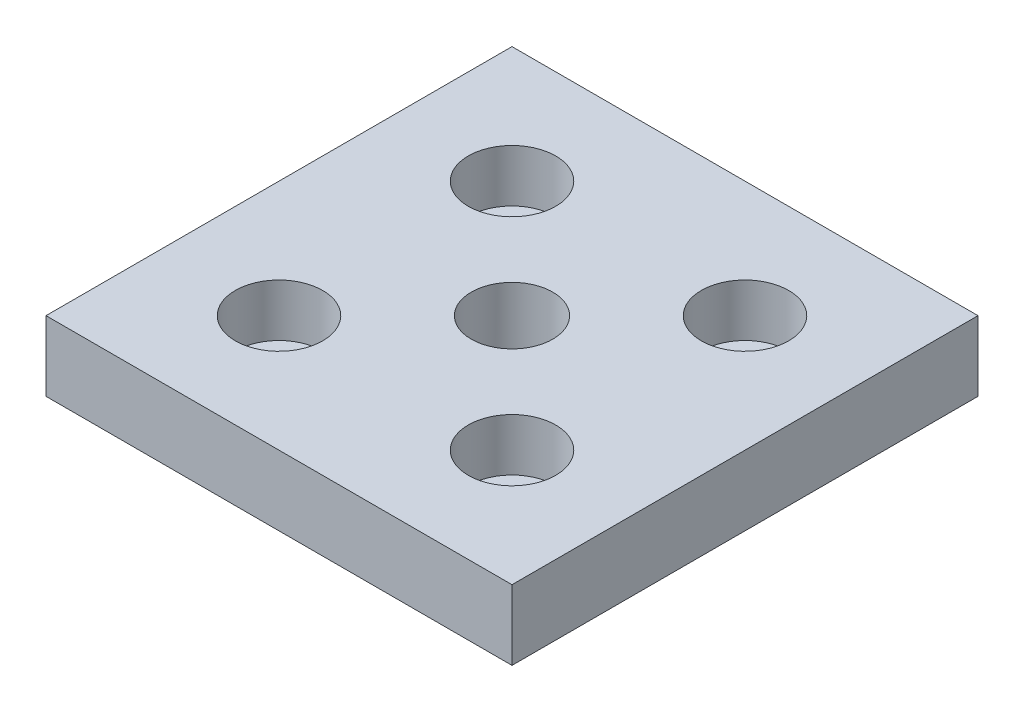
ISO-10303-21;
HEADER;
FILE_DESCRIPTION(('STEP AP214'),'2;1');
FILE_NAME('part.step','',(''),(''),'','','');
FILE_SCHEMA(('AUTOMOTIVE_DESIGN { 1 0 10303 214 1 1 1 1 }'));
ENDSEC;
DATA;
#1=APPLICATION_CONTEXT('core data for automotive mechanical design processes');
#2=APPLICATION_PROTOCOL_DEFINITION('international standard','automotive_design',2000,#1);
#3=PRODUCT_CONTEXT('',#1,'mechanical');
#4=PRODUCT('Part','Part','',(#3));
#5=PRODUCT_RELATED_PRODUCT_CATEGORY('part','',(#4));
#6=PRODUCT_DEFINITION_FORMATION('','',#4);
#7=PRODUCT_DEFINITION_CONTEXT('part definition',#1,'design');
#8=PRODUCT_DEFINITION('design','',#6,#7);
#9=PRODUCT_DEFINITION_SHAPE('','',#8);
#10=(LENGTH_UNIT() NAMED_UNIT(*) SI_UNIT(.MILLI.,.METRE.));
#11=(NAMED_UNIT(*) PLANE_ANGLE_UNIT() SI_UNIT($,.RADIAN.));
#12=(NAMED_UNIT(*) SI_UNIT($,.STERADIAN.) SOLID_ANGLE_UNIT());
#13=UNCERTAINTY_MEASURE_WITH_UNIT(LENGTH_MEASURE(1.E-05),#10,'distance_accuracy_value','');
#14=(GEOMETRIC_REPRESENTATION_CONTEXT(3) GLOBAL_UNCERTAINTY_ASSIGNED_CONTEXT((#13)) GLOBAL_UNIT_ASSIGNED_CONTEXT((#10,
#11,#12)) REPRESENTATION_CONTEXT('',''));
#15=CARTESIAN_POINT('',(0.,0.,0.));
#16=DIRECTION('',(0.,0.,1.));
#17=DIRECTION('',(1.,0.,0.));
#18=AXIS2_PLACEMENT_3D('',#15,#16,#17);
#19=CARTESIAN_POINT('',(-20.,0.,-20.));
#20=DIRECTION('',(0.,1.,0.));
#21=DIRECTION('',(0.,0.,1.));
#22=AXIS2_PLACEMENT_3D('',#19,#20,#21);
#23=CYLINDRICAL_SURFACE('',#22,4.5);
#24=CARTESIAN_POINT('',(-20.,0.,-20.));
#25=DIRECTION('',(0.,1.,0.));
#26=DIRECTION('',(0.,0.,1.));
#27=AXIS2_PLACEMENT_3D('',#24,#25,#26);
#28=CIRCLE('',#27,4.5);
#29=CARTESIAN_POINT('',(-20.,0.,-15.5));
#30=VERTEX_POINT('',#29);
#31=EDGE_CURVE('E137',#30,#30,#28,.T.);
#32=ORIENTED_EDGE('',*,*,#31,.F.);
#33=EDGE_LOOP('',(#32));
#34=FACE_BOUND('',#33,.T.);
#35=CARTESIAN_POINT('',(-20.,3.,-20.));
#36=DIRECTION('',(0.,1.,0.));
#37=DIRECTION('',(0.,0.,1.));
#38=AXIS2_PLACEMENT_3D('',#35,#36,#37);
#39=CIRCLE('',#38,4.5);
#40=CARTESIAN_POINT('',(-20.,3.,-15.5));
#41=VERTEX_POINT('',#40);
#42=EDGE_CURVE('E41',#41,#41,#39,.F.);
#43=ORIENTED_EDGE('',*,*,#42,.F.);
#44=EDGE_LOOP('',(#43));
#45=FACE_BOUND('',#44,.T.);
#46=ADVANCED_FACE('F37',(#34,#45),#23,.F.);
#47=CARTESIAN_POINT('',(20.,0.,-20.));
#48=DIRECTION('',(0.,1.,0.));
#49=DIRECTION('',(0.,0.,1.));
#50=AXIS2_PLACEMENT_3D('',#47,#48,#49);
#51=CYLINDRICAL_SURFACE('',#50,4.5);
#52=CARTESIAN_POINT('',(20.,0.,-20.));
#53=DIRECTION('',(0.,1.,0.));
#54=DIRECTION('',(0.,0.,1.));
#55=AXIS2_PLACEMENT_3D('',#52,#53,#54);
#56=CIRCLE('',#55,4.5);
#57=CARTESIAN_POINT('',(20.,0.,-15.5));
#58=VERTEX_POINT('',#57);
#59=EDGE_CURVE('E133',#58,#58,#56,.T.);
#60=ORIENTED_EDGE('',*,*,#59,.F.);
#61=EDGE_LOOP('',(#60));
#62=FACE_BOUND('',#61,.T.);
#63=CARTESIAN_POINT('',(20.,3.,-20.));
#64=DIRECTION('',(0.,1.,0.));
#65=DIRECTION('',(0.,0.,1.));
#66=AXIS2_PLACEMENT_3D('',#63,#64,#65);
#67=CIRCLE('',#66,4.5);
#68=CARTESIAN_POINT('',(20.,3.,-15.5));
#69=VERTEX_POINT('',#68);
#70=EDGE_CURVE('E119',#69,#69,#67,.F.);
#71=ORIENTED_EDGE('',*,*,#70,.F.);
#72=EDGE_LOOP('',(#71));
#73=FACE_BOUND('',#72,.T.);
#74=ADVANCED_FACE('F165',(#62,#73),#51,.F.);
#75=CARTESIAN_POINT('',(20.,0.,20.));
#76=DIRECTION('',(0.,1.,0.));
#77=DIRECTION('',(0.,0.,1.));
#78=AXIS2_PLACEMENT_3D('',#75,#76,#77);
#79=CYLINDRICAL_SURFACE('',#78,4.5);
#80=CARTESIAN_POINT('',(20.,0.,20.));
#81=DIRECTION('',(0.,1.,0.));
#82=DIRECTION('',(0.,0.,1.));
#83=AXIS2_PLACEMENT_3D('',#80,#81,#82);
#84=CIRCLE('',#83,4.5);
#85=CARTESIAN_POINT('',(20.,0.,24.5));
#86=VERTEX_POINT('',#85);
#87=EDGE_CURVE('E128',#86,#86,#84,.T.);
#88=ORIENTED_EDGE('',*,*,#87,.F.);
#89=EDGE_LOOP('',(#88));
#90=FACE_BOUND('',#89,.T.);
#91=CARTESIAN_POINT('',(20.,3.,20.));
#92=DIRECTION('',(0.,1.,0.));
#93=DIRECTION('',(0.,0.,1.));
#94=AXIS2_PLACEMENT_3D('',#91,#92,#93);
#95=CIRCLE('',#94,4.5);
#96=CARTESIAN_POINT('',(20.,3.,24.5));
#97=VERTEX_POINT('',#96);
#98=EDGE_CURVE('E116',#97,#97,#95,.F.);
#99=ORIENTED_EDGE('',*,*,#98,.F.);
#100=EDGE_LOOP('',(#99));
#101=FACE_BOUND('',#100,.T.);
#102=ADVANCED_FACE('F171',(#90,#101),#79,.F.);
#103=CARTESIAN_POINT('',(-20.,0.,20.));
#104=DIRECTION('',(0.,1.,0.));
#105=DIRECTION('',(0.,0.,1.));
#106=AXIS2_PLACEMENT_3D('',#103,#104,#105);
#107=CYLINDRICAL_SURFACE('',#106,4.5);
#108=CARTESIAN_POINT('',(-20.,0.,20.));
#109=DIRECTION('',(0.,1.,0.));
#110=DIRECTION('',(0.,0.,1.));
#111=AXIS2_PLACEMENT_3D('',#108,#109,#110);
#112=CIRCLE('',#111,4.5);
#113=CARTESIAN_POINT('',(-20.,0.,24.5));
#114=VERTEX_POINT('',#113);
#115=EDGE_CURVE('E124',#114,#114,#112,.T.);
#116=ORIENTED_EDGE('',*,*,#115,.F.);
#117=EDGE_LOOP('',(#116));
#118=FACE_BOUND('',#117,.T.);
#119=CARTESIAN_POINT('',(-20.,3.,20.));
#120=DIRECTION('',(0.,1.,0.));
#121=DIRECTION('',(0.,0.,1.));
#122=AXIS2_PLACEMENT_3D('',#119,#120,#121);
#123=CIRCLE('',#122,4.5);
#124=CARTESIAN_POINT('',(-20.,3.,24.5));
#125=VERTEX_POINT('',#124);
#126=EDGE_CURVE('E113',#125,#125,#123,.F.);
#127=ORIENTED_EDGE('',*,*,#126,.F.);
#128=EDGE_LOOP('',(#127));
#129=FACE_BOUND('',#128,.T.);
#130=ADVANCED_FACE('F178',(#118,#129),#107,.F.);
#131=CARTESIAN_POINT('',(40.,12.,40.));
#132=DIRECTION('',(-1.,0.,0.));
#133=DIRECTION('',(0.,0.,1.));
#134=AXIS2_PLACEMENT_3D('',#131,#132,#133);
#135=PLANE('',#134);
#136=DIRECTION('',(0.,0.,-1.));
#137=VECTOR('',#136,1.);
#138=CARTESIAN_POINT('',(40.,0.,40.));
#139=LINE('',#138,#137);
#140=CARTESIAN_POINT('',(40.,0.,40.));
#141=VERTEX_POINT('',#140);
#142=CARTESIAN_POINT('',(40.,0.,-40.));
#143=VERTEX_POINT('',#142);
#144=EDGE_CURVE('E104',#141,#143,#139,.T.);
#145=ORIENTED_EDGE('',*,*,#144,.T.);
#146=DIRECTION('',(0.,-1.,0.));
#147=VECTOR('',#146,1.);
#148=CARTESIAN_POINT('',(40.,12.,-40.));
#149=LINE('',#148,#147);
#150=CARTESIAN_POINT('',(40.,12.,-40.));
#151=VERTEX_POINT('',#150);
#152=EDGE_CURVE('E11',#151,#143,#149,.T.);
#153=ORIENTED_EDGE('',*,*,#152,.F.);
#154=DIRECTION('',(0.,0.,-1.));
#155=VECTOR('',#154,1.);
#156=CARTESIAN_POINT('',(40.,12.,40.));
#157=LINE('',#156,#155);
#158=CARTESIAN_POINT('',(40.,12.,40.));
#159=VERTEX_POINT('',#158);
#160=EDGE_CURVE('E91',#159,#151,#157,.T.);
#161=ORIENTED_EDGE('',*,*,#160,.F.);
#162=DIRECTION('',(0.,-1.,0.));
#163=VECTOR('',#162,1.);
#164=CARTESIAN_POINT('',(40.,12.,40.));
#165=LINE('',#164,#163);
#166=EDGE_CURVE('E100',#159,#141,#165,.T.);
#167=ORIENTED_EDGE('',*,*,#166,.T.);
#168=EDGE_LOOP('',(#145,#153,#161,#167));
#169=FACE_BOUND('',#168,.T.);
#170=ADVANCED_FACE('F39',(#169),#135,.F.);
#171=CARTESIAN_POINT('',(-40.,12.,-40.));
#172=DIRECTION('',(0.,0.,1.));
#173=DIRECTION('',(1.,0.,0.));
#174=AXIS2_PLACEMENT_3D('',#171,#172,#173);
#175=PLANE('',#174);
#176=DIRECTION('',(-1.,0.,0.));
#177=VECTOR('',#176,1.);
#178=CARTESIAN_POINT('',(-40.,0.,-40.));
#179=LINE('',#178,#177);
#180=CARTESIAN_POINT('',(-40.,0.,-40.));
#181=VERTEX_POINT('',#180);
#182=EDGE_CURVE('E95',#143,#181,#179,.T.);
#183=ORIENTED_EDGE('',*,*,#182,.T.);
#184=DIRECTION('',(0.,-1.,0.));
#185=VECTOR('',#184,1.);
#186=CARTESIAN_POINT('',(-40.,12.,-40.));
#187=LINE('',#186,#185);
#188=CARTESIAN_POINT('',(-40.,12.,-40.));
#189=VERTEX_POINT('',#188);
#190=EDGE_CURVE('E47',#189,#181,#187,.T.);
#191=ORIENTED_EDGE('',*,*,#190,.F.);
#192=DIRECTION('',(-1.,0.,0.));
#193=VECTOR('',#192,1.);
#194=CARTESIAN_POINT('',(-40.,12.,-40.));
#195=LINE('',#194,#193);
#196=EDGE_CURVE('E86',#151,#189,#195,.T.);
#197=ORIENTED_EDGE('',*,*,#196,.F.);
#198=ORIENTED_EDGE('',*,*,#152,.T.);
#199=EDGE_LOOP('',(#183,#191,#197,#198));
#200=FACE_BOUND('',#199,.T.);
#201=ADVANCED_FACE('F94',(#200),#175,.F.);
#202=CARTESIAN_POINT('',(-40.,12.,40.));
#203=DIRECTION('',(1.,0.,0.));
#204=DIRECTION('',(0.,0.,-1.));
#205=AXIS2_PLACEMENT_3D('',#202,#203,#204);
#206=PLANE('',#205);
#207=DIRECTION('',(0.,0.,1.));
#208=VECTOR('',#207,1.);
#209=CARTESIAN_POINT('',(-40.,0.,40.));
#210=LINE('',#209,#208);
#211=CARTESIAN_POINT('',(-40.,0.,40.));
#212=VERTEX_POINT('',#211);
#213=EDGE_CURVE('E73',#181,#212,#210,.T.);
#214=ORIENTED_EDGE('',*,*,#213,.T.);
#215=DIRECTION('',(0.,-1.,0.));
#216=VECTOR('',#215,1.);
#217=CARTESIAN_POINT('',(-40.,12.,40.));
#218=LINE('',#217,#216);
#219=CARTESIAN_POINT('',(-40.,12.,40.));
#220=VERTEX_POINT('',#219);
#221=EDGE_CURVE('E96',#220,#212,#218,.T.);
#222=ORIENTED_EDGE('',*,*,#221,.F.);
#223=DIRECTION('',(0.,0.,1.));
#224=VECTOR('',#223,1.);
#225=CARTESIAN_POINT('',(-40.,12.,40.));
#226=LINE('',#225,#224);
#227=EDGE_CURVE('E89',#189,#220,#226,.T.);
#228=ORIENTED_EDGE('',*,*,#227,.F.);
#229=ORIENTED_EDGE('',*,*,#190,.T.);
#230=EDGE_LOOP('',(#214,#222,#228,#229));
#231=FACE_BOUND('',#230,.T.);
#232=ADVANCED_FACE('F98',(#231),#206,.F.);
#233=CARTESIAN_POINT('',(-40.,12.,40.));
#234=DIRECTION('',(0.,0.,-1.));
#235=DIRECTION('',(-1.,0.,0.));
#236=AXIS2_PLACEMENT_3D('',#233,#234,#235);
#237=PLANE('',#236);
#238=DIRECTION('',(1.,0.,0.));
#239=VECTOR('',#238,1.);
#240=CARTESIAN_POINT('',(-40.,0.,40.));
#241=LINE('',#240,#239);
#242=EDGE_CURVE('E79',#212,#141,#241,.T.);
#243=ORIENTED_EDGE('',*,*,#242,.T.);
#244=ORIENTED_EDGE('',*,*,#166,.F.);
#245=DIRECTION('',(1.,0.,0.));
#246=VECTOR('',#245,1.);
#247=CARTESIAN_POINT('',(-40.,12.,40.));
#248=LINE('',#247,#246);
#249=EDGE_CURVE('E56',#220,#159,#248,.T.);
#250=ORIENTED_EDGE('',*,*,#249,.F.);
#251=ORIENTED_EDGE('',*,*,#221,.T.);
#252=EDGE_LOOP('',(#243,#244,#250,#251));
#253=FACE_BOUND('',#252,.T.);
#254=ADVANCED_FACE('F154',(#253),#237,.F.);
#255=CARTESIAN_POINT('',(0.,12.,0.));
#256=DIRECTION('',(0.,-1.,0.));
#257=DIRECTION('',(0.,0.,-1.));
#258=AXIS2_PLACEMENT_3D('',#255,#256,#257);
#259=PLANE('',#258);
#260=CARTESIAN_POINT('',(-20.,12.,20.));
#261=DIRECTION('',(0.,1.,0.));
#262=DIRECTION('',(0.,0.,1.));
#263=AXIS2_PLACEMENT_3D('',#260,#261,#262);
#264=CIRCLE('',#263,7.5);
#265=CARTESIAN_POINT('',(-20.,12.,27.5));
#266=VERTEX_POINT('',#265);
#267=EDGE_CURVE('E255',#266,#266,#264,.T.);
#268=ORIENTED_EDGE('',*,*,#267,.F.);
#269=EDGE_LOOP('',(#268));
#270=FACE_BOUND('',#269,.T.);
#271=CARTESIAN_POINT('',(20.,12.,20.));
#272=DIRECTION('',(0.,1.,0.));
#273=DIRECTION('',(0.,0.,1.));
#274=AXIS2_PLACEMENT_3D('',#271,#272,#273);
#275=CIRCLE('',#274,7.5);
#276=CARTESIAN_POINT('',(20.,12.,27.5));
#277=VERTEX_POINT('',#276);
#278=EDGE_CURVE('E250',#277,#277,#275,.T.);
#279=ORIENTED_EDGE('',*,*,#278,.F.);
#280=EDGE_LOOP('',(#279));
#281=FACE_BOUND('',#280,.T.);
#282=CARTESIAN_POINT('',(20.,12.,-20.));
#283=DIRECTION('',(0.,1.,0.));
#284=DIRECTION('',(0.,0.,1.));
#285=AXIS2_PLACEMENT_3D('',#282,#283,#284);
#286=CIRCLE('',#285,7.5);
#287=CARTESIAN_POINT('',(20.,12.,-12.5));
#288=VERTEX_POINT('',#287);
#289=EDGE_CURVE('E241',#288,#288,#286,.T.);
#290=ORIENTED_EDGE('',*,*,#289,.F.);
#291=EDGE_LOOP('',(#290));
#292=FACE_BOUND('',#291,.T.);
#293=CARTESIAN_POINT('',(-20.,12.,-20.));
#294=DIRECTION('',(0.,1.,0.));
#295=DIRECTION('',(0.,0.,1.));
#296=AXIS2_PLACEMENT_3D('',#293,#294,#295);
#297=CIRCLE('',#296,7.5);
#298=CARTESIAN_POINT('',(-20.,12.,-12.5));
#299=VERTEX_POINT('',#298);
#300=EDGE_CURVE('E240',#299,#299,#297,.T.);
#301=ORIENTED_EDGE('',*,*,#300,.F.);
#302=EDGE_LOOP('',(#301));
#303=FACE_BOUND('',#302,.T.);
#304=CARTESIAN_POINT('',(0.,12.,0.));
#305=DIRECTION('',(0.,1.,0.));
#306=DIRECTION('',(0.,0.,1.));
#307=AXIS2_PLACEMENT_3D('',#304,#305,#306);
#308=CIRCLE('',#307,7.);
#309=CARTESIAN_POINT('',(0.,12.,7.));
#310=VERTEX_POINT('',#309);
#311=EDGE_CURVE('E140',#310,#310,#308,.T.);
#312=ORIENTED_EDGE('',*,*,#311,.F.);
#313=EDGE_LOOP('',(#312));
#314=FACE_BOUND('',#313,.T.);
#315=ORIENTED_EDGE('',*,*,#160,.T.);
#316=ORIENTED_EDGE('',*,*,#196,.T.);
#317=ORIENTED_EDGE('',*,*,#227,.T.);
#318=ORIENTED_EDGE('',*,*,#249,.T.);
#319=EDGE_LOOP('',(#315,#316,#317,#318));
#320=FACE_BOUND('',#319,.T.);
#321=ADVANCED_FACE('F87',(#270,#281,#292,#303,#314,#320),#259,.F.);
#322=CARTESIAN_POINT('',(0.,0.,0.));
#323=DIRECTION('',(0.,-1.,0.));
#324=DIRECTION('',(0.,0.,-1.));
#325=AXIS2_PLACEMENT_3D('',#322,#323,#324);
#326=PLANE('',#325);
#327=ORIENTED_EDGE('',*,*,#115,.T.);
#328=EDGE_LOOP('',(#327));
#329=FACE_BOUND('',#328,.T.);
#330=ORIENTED_EDGE('',*,*,#87,.T.);
#331=EDGE_LOOP('',(#330));
#332=FACE_BOUND('',#331,.T.);
#333=ORIENTED_EDGE('',*,*,#59,.T.);
#334=EDGE_LOOP('',(#333));
#335=FACE_BOUND('',#334,.T.);
#336=ORIENTED_EDGE('',*,*,#31,.T.);
#337=EDGE_LOOP('',(#336));
#338=FACE_BOUND('',#337,.T.);
#339=CARTESIAN_POINT('',(0.,0.,0.));
#340=DIRECTION('',(0.,-1.,0.));
#341=DIRECTION('',(0.,0.,-1.));
#342=AXIS2_PLACEMENT_3D('',#339,#340,#341);
#343=CIRCLE('',#342,7.);
#344=CARTESIAN_POINT('',(0.,0.,-7.));
#345=VERTEX_POINT('',#344);
#346=EDGE_CURVE('E107',#345,#345,#343,.T.);
#347=ORIENTED_EDGE('',*,*,#346,.F.);
#348=EDGE_LOOP('',(#347));
#349=FACE_BOUND('',#348,.T.);
#350=ORIENTED_EDGE('',*,*,#144,.F.);
#351=ORIENTED_EDGE('',*,*,#242,.F.);
#352=ORIENTED_EDGE('',*,*,#213,.F.);
#353=ORIENTED_EDGE('',*,*,#182,.F.);
#354=EDGE_LOOP('',(#350,#351,#352,#353));
#355=FACE_BOUND('',#354,.T.);
#356=ADVANCED_FACE('F148',(#329,#332,#335,#338,#349,#355),#326,.T.);
#357=CARTESIAN_POINT('',(0.,12.,0.));
#358=DIRECTION('',(0.,1.,0.));
#359=DIRECTION('',(0.,0.,1.));
#360=AXIS2_PLACEMENT_3D('',#357,#358,#359);
#361=CYLINDRICAL_SURFACE('',#360,7.);
#362=ORIENTED_EDGE('',*,*,#311,.T.);
#363=EDGE_LOOP('',(#362));
#364=FACE_BOUND('',#363,.T.);
#365=ORIENTED_EDGE('',*,*,#346,.T.);
#366=EDGE_LOOP('',(#365));
#367=FACE_BOUND('',#366,.T.);
#368=ADVANCED_FACE('F146',(#364,#367),#361,.F.);
#369=CARTESIAN_POINT('',(-20.,3.,20.));
#370=DIRECTION('',(0.,1.,0.));
#371=DIRECTION('',(0.,0.,1.));
#372=AXIS2_PLACEMENT_3D('',#369,#370,#371);
#373=PLANE('',#372);
#374=CARTESIAN_POINT('',(-20.,3.,20.));
#375=DIRECTION('',(0.,1.,0.));
#376=DIRECTION('',(0.,0.,1.));
#377=AXIS2_PLACEMENT_3D('',#374,#375,#376);
#378=CIRCLE('',#377,7.5);
#379=CARTESIAN_POINT('',(-20.,3.,27.5));
#380=VERTEX_POINT('',#379);
#381=EDGE_CURVE('E253',#380,#380,#378,.T.);
#382=ORIENTED_EDGE('',*,*,#381,.T.);
#383=EDGE_LOOP('',(#382));
#384=FACE_BOUND('',#383,.T.);
#385=ORIENTED_EDGE('',*,*,#126,.T.);
#386=EDGE_LOOP('',(#385));
#387=FACE_BOUND('',#386,.T.);
#388=ADVANCED_FACE('F181',(#384,#387),#373,.T.);
#389=CARTESIAN_POINT('',(-20.,3.,20.));
#390=DIRECTION('',(0.,1.,0.));
#391=DIRECTION('',(0.,0.,1.));
#392=AXIS2_PLACEMENT_3D('',#389,#390,#391);
#393=CYLINDRICAL_SURFACE('',#392,7.5);
#394=ORIENTED_EDGE('',*,*,#381,.F.);
#395=EDGE_LOOP('',(#394));
#396=FACE_BOUND('',#395,.T.);
#397=ORIENTED_EDGE('',*,*,#267,.T.);
#398=EDGE_LOOP('',(#397));
#399=FACE_BOUND('',#398,.T.);
#400=ADVANCED_FACE('F186',(#396,#399),#393,.F.);
#401=CARTESIAN_POINT('',(20.,3.,20.));
#402=DIRECTION('',(0.,1.,0.));
#403=DIRECTION('',(0.,0.,1.));
#404=AXIS2_PLACEMENT_3D('',#401,#402,#403);
#405=PLANE('',#404);
#406=CARTESIAN_POINT('',(20.,3.,20.));
#407=DIRECTION('',(0.,1.,0.));
#408=DIRECTION('',(0.,0.,1.));
#409=AXIS2_PLACEMENT_3D('',#406,#407,#408);
#410=CIRCLE('',#409,7.5);
#411=CARTESIAN_POINT('',(20.,3.,27.5));
#412=VERTEX_POINT('',#411);
#413=EDGE_CURVE('E246',#412,#412,#410,.T.);
#414=ORIENTED_EDGE('',*,*,#413,.T.);
#415=EDGE_LOOP('',(#414));
#416=FACE_BOUND('',#415,.T.);
#417=ORIENTED_EDGE('',*,*,#98,.T.);
#418=EDGE_LOOP('',(#417));
#419=FACE_BOUND('',#418,.T.);
#420=ADVANCED_FACE('F194',(#416,#419),#405,.T.);
#421=CARTESIAN_POINT('',(20.,3.,20.));
#422=DIRECTION('',(0.,1.,0.));
#423=DIRECTION('',(0.,0.,1.));
#424=AXIS2_PLACEMENT_3D('',#421,#422,#423);
#425=CYLINDRICAL_SURFACE('',#424,7.5);
#426=ORIENTED_EDGE('',*,*,#413,.F.);
#427=EDGE_LOOP('',(#426));
#428=FACE_BOUND('',#427,.T.);
#429=ORIENTED_EDGE('',*,*,#278,.T.);
#430=EDGE_LOOP('',(#429));
#431=FACE_BOUND('',#430,.T.);
#432=ADVANCED_FACE('F200',(#428,#431),#425,.F.);
#433=CARTESIAN_POINT('',(20.,3.,-20.));
#434=DIRECTION('',(0.,1.,0.));
#435=DIRECTION('',(0.,0.,1.));
#436=AXIS2_PLACEMENT_3D('',#433,#434,#435);
#437=PLANE('',#436);
#438=CARTESIAN_POINT('',(20.,3.,-20.));
#439=DIRECTION('',(0.,1.,0.));
#440=DIRECTION('',(0.,0.,1.));
#441=AXIS2_PLACEMENT_3D('',#438,#439,#440);
#442=CIRCLE('',#441,7.5);
#443=CARTESIAN_POINT('',(20.,3.,-12.5));
#444=VERTEX_POINT('',#443);
#445=EDGE_CURVE('E239',#444,#444,#442,.T.);
#446=ORIENTED_EDGE('',*,*,#445,.T.);
#447=EDGE_LOOP('',(#446));
#448=FACE_BOUND('',#447,.T.);
#449=ORIENTED_EDGE('',*,*,#70,.T.);
#450=EDGE_LOOP('',(#449));
#451=FACE_BOUND('',#450,.T.);
#452=ADVANCED_FACE('F226',(#448,#451),#437,.T.);
#453=CARTESIAN_POINT('',(20.,3.,-20.));
#454=DIRECTION('',(0.,1.,0.));
#455=DIRECTION('',(0.,0.,1.));
#456=AXIS2_PLACEMENT_3D('',#453,#454,#455);
#457=CYLINDRICAL_SURFACE('',#456,7.5);
#458=ORIENTED_EDGE('',*,*,#445,.F.);
#459=EDGE_LOOP('',(#458));
#460=FACE_BOUND('',#459,.T.);
#461=ORIENTED_EDGE('',*,*,#289,.T.);
#462=EDGE_LOOP('',(#461));
#463=FACE_BOUND('',#462,.T.);
#464=ADVANCED_FACE('F207',(#460,#463),#457,.F.);
#465=CARTESIAN_POINT('',(-20.,3.,-20.));
#466=DIRECTION('',(0.,1.,0.));
#467=DIRECTION('',(0.,0.,1.));
#468=AXIS2_PLACEMENT_3D('',#465,#466,#467);
#469=PLANE('',#468);
#470=CARTESIAN_POINT('',(-20.,3.,-20.));
#471=DIRECTION('',(0.,1.,0.));
#472=DIRECTION('',(0.,0.,1.));
#473=AXIS2_PLACEMENT_3D('',#470,#471,#472);
#474=CIRCLE('',#473,7.5);
#475=CARTESIAN_POINT('',(-20.,3.,-12.5));
#476=VERTEX_POINT('',#475);
#477=EDGE_CURVE('E117',#476,#476,#474,.T.);
#478=ORIENTED_EDGE('',*,*,#477,.T.);
#479=EDGE_LOOP('',(#478));
#480=FACE_BOUND('',#479,.T.);
#481=ORIENTED_EDGE('',*,*,#42,.T.);
#482=EDGE_LOOP('',(#481));
#483=FACE_BOUND('',#482,.T.);
#484=ADVANCED_FACE('F203',(#480,#483),#469,.T.);
#485=CARTESIAN_POINT('',(-20.,3.,-20.));
#486=DIRECTION('',(0.,1.,0.));
#487=DIRECTION('',(0.,0.,1.));
#488=AXIS2_PLACEMENT_3D('',#485,#486,#487);
#489=CYLINDRICAL_SURFACE('',#488,7.5);
#490=ORIENTED_EDGE('',*,*,#477,.F.);
#491=EDGE_LOOP('',(#490));
#492=FACE_BOUND('',#491,.T.);
#493=ORIENTED_EDGE('',*,*,#300,.T.);
#494=EDGE_LOOP('',(#493));
#495=FACE_BOUND('',#494,.T.);
#496=ADVANCED_FACE('F206',(#492,#495),#489,.F.);
#497=CLOSED_SHELL('',(#46,#74,#102,#130,#170,#201,#232,#254,#321,#356,#368,#388,#400,#420,#432,
#452,#464,#484,#496));
#498=MANIFOLD_SOLID_BREP('B2',#497);
#499=ADVANCED_BREP_SHAPE_REPRESENTATION('',(#18,#498),#14);
#500=SHAPE_DEFINITION_REPRESENTATION(#9,#499);
ENDSEC;
END-ISO-10303-21;
